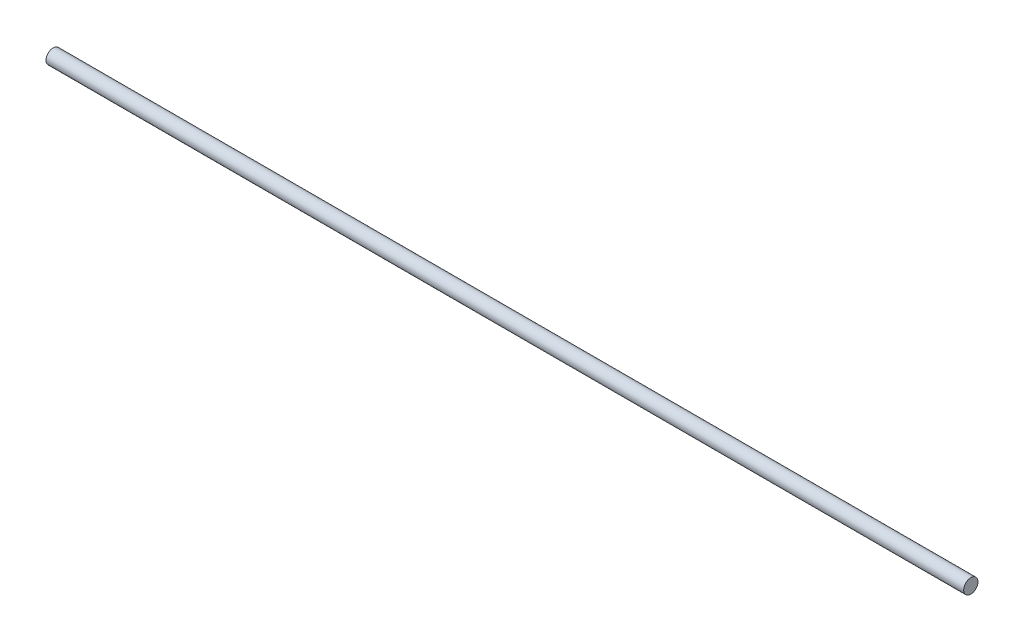
ISO-10303-21;
HEADER;
FILE_DESCRIPTION(('STEP AP214'),'2;1');
FILE_NAME('part.step','',(''),(''),'','','');
FILE_SCHEMA(('AUTOMOTIVE_DESIGN { 1 0 10303 214 1 1 1 1 }'));
ENDSEC;
DATA;
#1=APPLICATION_CONTEXT('core data for automotive mechanical design processes');
#2=APPLICATION_PROTOCOL_DEFINITION('international standard','automotive_design',2000,#1);
#3=PRODUCT_CONTEXT('',#1,'mechanical');
#4=PRODUCT('Part','Part','',(#3));
#5=PRODUCT_RELATED_PRODUCT_CATEGORY('part','',(#4));
#6=PRODUCT_DEFINITION_FORMATION('','',#4);
#7=PRODUCT_DEFINITION_CONTEXT('part definition',#1,'design');
#8=PRODUCT_DEFINITION('design','',#6,#7);
#9=PRODUCT_DEFINITION_SHAPE('','',#8);
#10=(LENGTH_UNIT() NAMED_UNIT(*) SI_UNIT(.MILLI.,.METRE.));
#11=(NAMED_UNIT(*) PLANE_ANGLE_UNIT() SI_UNIT($,.RADIAN.));
#12=(NAMED_UNIT(*) SI_UNIT($,.STERADIAN.) SOLID_ANGLE_UNIT());
#13=UNCERTAINTY_MEASURE_WITH_UNIT(LENGTH_MEASURE(1.E-05),#10,'distance_accuracy_value','');
#14=(GEOMETRIC_REPRESENTATION_CONTEXT(3) GLOBAL_UNCERTAINTY_ASSIGNED_CONTEXT((#13)) GLOBAL_UNIT_ASSIGNED_CONTEXT((#10,
#11,#12)) REPRESENTATION_CONTEXT('',''));
#15=CARTESIAN_POINT('',(0.,0.,0.));
#16=DIRECTION('',(0.,0.,1.));
#17=DIRECTION('',(1.,0.,0.));
#18=AXIS2_PLACEMENT_3D('',#15,#16,#17);
#19=CARTESIAN_POINT('',(609.6,0.,0.));
#20=DIRECTION('',(-1.,0.,0.));
#21=DIRECTION('',(0.,0.,1.));
#22=AXIS2_PLACEMENT_3D('',#19,#20,#21);
#23=CYLINDRICAL_SURFACE('',#22,4.7625);
#24=CARTESIAN_POINT('',(609.6,0.,0.));
#25=DIRECTION('',(1.,0.,0.));
#26=DIRECTION('',(0.,0.,-1.));
#27=AXIS2_PLACEMENT_3D('',#24,#25,#26);
#28=CIRCLE('',#27,4.7625);
#29=CARTESIAN_POINT('',(609.6,0.,-4.7625));
#30=VERTEX_POINT('',#29);
#31=EDGE_CURVE('E10',#30,#30,#28,.T.);
#32=ORIENTED_EDGE('',*,*,#31,.F.);
#33=EDGE_LOOP('',(#32));
#34=FACE_BOUND('',#33,.T.);
#35=CARTESIAN_POINT('',(0.,0.,0.));
#36=DIRECTION('',(1.,0.,0.));
#37=DIRECTION('',(0.,0.,-1.));
#38=AXIS2_PLACEMENT_3D('',#35,#36,#37);
#39=CIRCLE('',#38,4.7625);
#40=CARTESIAN_POINT('',(0.,0.,-4.7625));
#41=VERTEX_POINT('',#40);
#42=EDGE_CURVE('E39',#41,#41,#39,.T.);
#43=ORIENTED_EDGE('',*,*,#42,.T.);
#44=EDGE_LOOP('',(#43));
#45=FACE_BOUND('',#44,.T.);
#46=ADVANCED_FACE('F36',(#34,#45),#23,.T.);
#47=CARTESIAN_POINT('',(609.6,0.,0.));
#48=DIRECTION('',(1.,0.,0.));
#49=DIRECTION('',(0.,0.,-1.));
#50=AXIS2_PLACEMENT_3D('',#47,#48,#49);
#51=PLANE('',#50);
#52=ORIENTED_EDGE('',*,*,#31,.T.);
#53=EDGE_LOOP('',(#52));
#54=FACE_BOUND('',#53,.T.);
#55=ADVANCED_FACE('F53',(#54),#51,.T.);
#56=CARTESIAN_POINT('',(0.,0.,0.));
#57=DIRECTION('',(1.,0.,0.));
#58=DIRECTION('',(0.,0.,-1.));
#59=AXIS2_PLACEMENT_3D('',#56,#57,#58);
#60=PLANE('',#59);
#61=ORIENTED_EDGE('',*,*,#42,.F.);
#62=EDGE_LOOP('',(#61));
#63=FACE_BOUND('',#62,.T.);
#64=ADVANCED_FACE('F51',(#63),#60,.F.);
#65=CLOSED_SHELL('',(#46,#55,#64));
#66=MANIFOLD_SOLID_BREP('B2',#65);
#67=ADVANCED_BREP_SHAPE_REPRESENTATION('',(#18,#66),#14);
#68=SHAPE_DEFINITION_REPRESENTATION(#9,#67);
ENDSEC;
END-ISO-10303-21;
